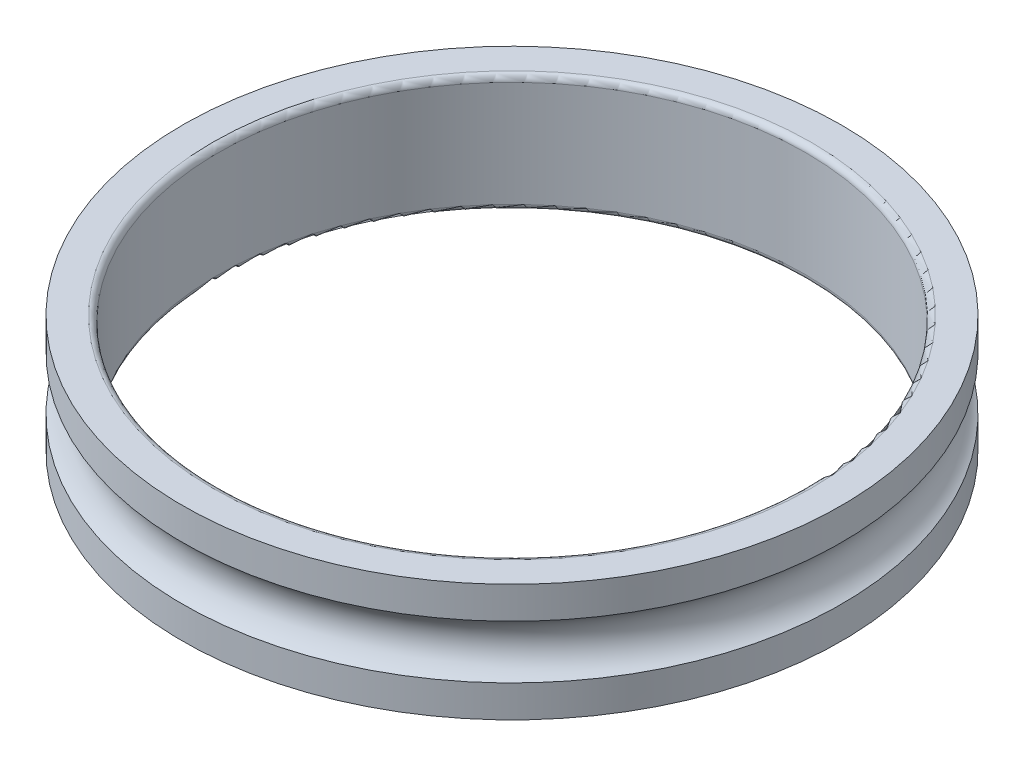
ISO-10303-21;
HEADER;
FILE_DESCRIPTION(('STEP AP214'),'2;1');
FILE_NAME('part.step','',(''),(''),'','','');
FILE_SCHEMA(('AUTOMOTIVE_DESIGN { 1 0 10303 214 1 1 1 1 }'));
ENDSEC;
DATA;
#1=APPLICATION_CONTEXT('core data for automotive mechanical design processes');
#2=APPLICATION_PROTOCOL_DEFINITION('international standard','automotive_design',2000,#1);
#3=PRODUCT_CONTEXT('',#1,'mechanical');
#4=PRODUCT('Part','Part','',(#3));
#5=PRODUCT_RELATED_PRODUCT_CATEGORY('part','',(#4));
#6=PRODUCT_DEFINITION_FORMATION('','',#4);
#7=PRODUCT_DEFINITION_CONTEXT('part definition',#1,'design');
#8=PRODUCT_DEFINITION('design','',#6,#7);
#9=PRODUCT_DEFINITION_SHAPE('','',#8);
#10=(LENGTH_UNIT() NAMED_UNIT(*) SI_UNIT(.MILLI.,.METRE.));
#11=(NAMED_UNIT(*) PLANE_ANGLE_UNIT() SI_UNIT($,.RADIAN.));
#12=(NAMED_UNIT(*) SI_UNIT($,.STERADIAN.) SOLID_ANGLE_UNIT());
#13=UNCERTAINTY_MEASURE_WITH_UNIT(LENGTH_MEASURE(1.E-05),#10,'distance_accuracy_value','');
#14=(GEOMETRIC_REPRESENTATION_CONTEXT(3) GLOBAL_UNCERTAINTY_ASSIGNED_CONTEXT((#13)) GLOBAL_UNIT_ASSIGNED_CONTEXT((#10,
#11,#12)) REPRESENTATION_CONTEXT('',''));
#15=CARTESIAN_POINT('',(0.,0.,0.));
#16=DIRECTION('',(0.,0.,1.));
#17=DIRECTION('',(1.,0.,0.));
#18=AXIS2_PLACEMENT_3D('',#15,#16,#17);
#19=CARTESIAN_POINT('',(0.,-0.54533666301317,0.));
#20=DIRECTION('',(0.,1.,0.));
#21=DIRECTION('',(0.,0.,1.));
#22=AXIS2_PLACEMENT_3D('',#19,#20,#21);
#23=CYLINDRICAL_SURFACE('',#22,11.225);
#24=CARTESIAN_POINT('',(0.,0.,0.));
#25=DIRECTION('',(0.,1.,0.));
#26=DIRECTION('',(0.,0.,1.));
#27=AXIS2_PLACEMENT_3D('',#24,#25,#26);
#28=CIRCLE('',#27,11.225);
#29=CARTESIAN_POINT('',(0.,0.,-11.225));
#30=VERTEX_POINT('',#29);
#31=EDGE_CURVE('E11',#30,#30,#28,.T.);
#32=ORIENTED_EDGE('',*,*,#31,.F.);
#33=EDGE_LOOP('',(#32));
#34=FACE_BOUND('',#33,.T.);
#35=CARTESIAN_POINT('',(0.,-1.09067332602634,0.));
#36=DIRECTION('',(0.,1.,0.));
#37=DIRECTION('',(0.,0.,1.));
#38=AXIS2_PLACEMENT_3D('',#35,#36,#37);
#39=CIRCLE('',#38,11.225);
#40=CARTESIAN_POINT('',(2.12434521794557,-1.09067332602634,11.0221496267739));
#41=VERTEX_POINT('',#40);
#42=EDGE_CURVE('E64',#41,#41,#39,.T.);
#43=ORIENTED_EDGE('',*,*,#42,.T.);
#44=EDGE_LOOP('',(#43));
#45=FACE_BOUND('',#44,.T.);
#46=ADVANCED_FACE('F17',(#34,#45),#23,.T.);
#47=CARTESIAN_POINT('',(0.,0.,10.7125));
#48=DIRECTION('',(0.,1.,0.));
#49=DIRECTION('',(1.,0.,0.));
#50=AXIS2_PLACEMENT_3D('',#47,#48,#49);
#51=PLANE('',#50);
#52=ORIENTED_EDGE('',*,*,#31,.T.);
#53=EDGE_LOOP('',(#52));
#54=FACE_BOUND('',#53,.T.);
#55=CARTESIAN_POINT('',(0.,0.,0.));
#56=DIRECTION('',(0.,1.,0.));
#57=DIRECTION('',(0.,0.,1.));
#58=AXIS2_PLACEMENT_3D('',#55,#56,#57);
#59=CIRCLE('',#58,10.2);
#60=CARTESIAN_POINT('',(0.,0.,-10.2));
#61=VERTEX_POINT('',#60);
#62=EDGE_CURVE('E71',#61,#61,#59,.T.);
#63=ORIENTED_EDGE('',*,*,#62,.F.);
#64=EDGE_LOOP('',(#63));
#65=FACE_BOUND('',#64,.T.);
#66=ADVANCED_FACE('F112',(#54,#65),#51,.T.);
#67=CARTESIAN_POINT('',(0.,-3.45466333698683,0.));
#68=DIRECTION('',(0.,1.,0.));
#69=DIRECTION('',(0.,0.,1.));
#70=AXIS2_PLACEMENT_3D('',#67,#68,#69);
#71=CYLINDRICAL_SURFACE('',#70,11.225);
#72=CARTESIAN_POINT('',(0.,-2.90932667397366,0.));
#73=DIRECTION('',(0.,1.,0.));
#74=DIRECTION('',(0.,0.,1.));
#75=AXIS2_PLACEMENT_3D('',#72,#73,#74);
#76=CIRCLE('',#75,11.225);
#77=CARTESIAN_POINT('',(2.12434521794557,-2.90932667397366,11.0221496267739));
#78=VERTEX_POINT('',#77);
#79=EDGE_CURVE('E81',#78,#78,#76,.T.);
#80=ORIENTED_EDGE('',*,*,#79,.F.);
#81=EDGE_LOOP('',(#80));
#82=FACE_BOUND('',#81,.T.);
#83=CARTESIAN_POINT('',(0.,-4.,0.));
#84=DIRECTION('',(0.,1.,0.));
#85=DIRECTION('',(0.,0.,1.));
#86=AXIS2_PLACEMENT_3D('',#83,#84,#85);
#87=CIRCLE('',#86,11.225);
#88=CARTESIAN_POINT('',(0.,-4.,-11.225));
#89=VERTEX_POINT('',#88);
#90=EDGE_CURVE('E20',#89,#89,#87,.T.);
#91=ORIENTED_EDGE('',*,*,#90,.T.);
#92=EDGE_LOOP('',(#91));
#93=FACE_BOUND('',#92,.T.);
#94=ADVANCED_FACE('F99',(#82,#93),#71,.T.);
#95=CARTESIAN_POINT('',(0.,-4.,10.7125));
#96=DIRECTION('',(0.,-1.,0.));
#97=DIRECTION('',(-1.,0.,0.));
#98=AXIS2_PLACEMENT_3D('',#95,#96,#97);
#99=PLANE('',#98);
#100=CARTESIAN_POINT('',(0.,-4.,0.));
#101=DIRECTION('',(0.,1.,0.));
#102=DIRECTION('',(0.,0.,1.));
#103=AXIS2_PLACEMENT_3D('',#100,#101,#102);
#104=CIRCLE('',#103,10.2);
#105=CARTESIAN_POINT('',(0.,-4.,-10.2));
#106=VERTEX_POINT('',#105);
#107=EDGE_CURVE('E75',#106,#106,#104,.T.);
#108=ORIENTED_EDGE('',*,*,#107,.T.);
#109=EDGE_LOOP('',(#108));
#110=FACE_BOUND('',#109,.T.);
#111=ORIENTED_EDGE('',*,*,#90,.F.);
#112=EDGE_LOOP('',(#111));
#113=FACE_BOUND('',#112,.T.);
#114=ADVANCED_FACE('F101',(#110,#113),#99,.T.);
#115=CARTESIAN_POINT('',(0.,-2.,0.));
#116=DIRECTION('',(0.,1.,0.));
#117=DIRECTION('',(0.,0.,1.));
#118=AXIS2_PLACEMENT_3D('',#115,#116,#117);
#119=TOROIDAL_SURFACE('',#118,11.75,1.05);
#120=ORIENTED_EDGE('',*,*,#79,.T.);
#121=EDGE_LOOP('',(#120));
#122=FACE_BOUND('',#121,.T.);
#123=ORIENTED_EDGE('',*,*,#42,.F.);
#124=EDGE_LOOP('',(#123));
#125=FACE_BOUND('',#124,.T.);
#126=ADVANCED_FACE('F103',(#122,#125),#119,.F.);
#127=CARTESIAN_POINT('',(0.,-0.2,0.));
#128=DIRECTION('',(0.,1.,0.));
#129=DIRECTION('',(0.,0.,1.));
#130=AXIS2_PLACEMENT_3D('',#127,#128,#129);
#131=TOROIDAL_SURFACE('',#130,10.2,0.2);
#132=CARTESIAN_POINT('',(0.,-0.2,0.));
#133=DIRECTION('',(0.,1.,0.));
#134=DIRECTION('',(0.,0.,1.));
#135=AXIS2_PLACEMENT_3D('',#132,#133,#134);
#136=CIRCLE('',#135,10.);
#137=CARTESIAN_POINT('',(0.,-0.2,-10.));
#138=VERTEX_POINT('',#137);
#139=EDGE_CURVE('E138',#138,#138,#136,.T.);
#140=ORIENTED_EDGE('',*,*,#139,.F.);
#141=EDGE_LOOP('',(#140));
#142=FACE_BOUND('',#141,.T.);
#143=ORIENTED_EDGE('',*,*,#62,.T.);
#144=EDGE_LOOP('',(#143));
#145=FACE_BOUND('',#144,.T.);
#146=ADVANCED_FACE('F72',(#142,#145),#131,.T.);
#147=CARTESIAN_POINT('',(0.,-3.8,0.));
#148=DIRECTION('',(0.,1.,0.));
#149=DIRECTION('',(0.,0.,1.));
#150=AXIS2_PLACEMENT_3D('',#147,#148,#149);
#151=TOROIDAL_SURFACE('',#150,10.2,0.2);
#152=ORIENTED_EDGE('',*,*,#107,.F.);
#153=EDGE_LOOP('',(#152));
#154=FACE_BOUND('',#153,.T.);
#155=CARTESIAN_POINT('',(0.,-3.8,0.));
#156=DIRECTION('',(0.,1.,0.));
#157=DIRECTION('',(0.,0.,1.));
#158=AXIS2_PLACEMENT_3D('',#155,#156,#157);
#159=CIRCLE('',#158,10.);
#160=CARTESIAN_POINT('',(0.,-3.8,-10.));
#161=VERTEX_POINT('',#160);
#162=EDGE_CURVE('E84',#161,#161,#159,.T.);
#163=ORIENTED_EDGE('',*,*,#162,.T.);
#164=EDGE_LOOP('',(#163));
#165=FACE_BOUND('',#164,.T.);
#166=ADVANCED_FACE('F126',(#154,#165),#151,.T.);
#167=CARTESIAN_POINT('',(0.,-2.,0.));
#168=DIRECTION('',(0.,1.,0.));
#169=DIRECTION('',(0.,0.,1.));
#170=AXIS2_PLACEMENT_3D('',#167,#168,#169);
#171=CYLINDRICAL_SURFACE('',#170,10.);
#172=ORIENTED_EDGE('',*,*,#162,.F.);
#173=EDGE_LOOP('',(#172));
#174=FACE_BOUND('',#173,.T.);
#175=ORIENTED_EDGE('',*,*,#139,.T.);
#176=EDGE_LOOP('',(#175));
#177=FACE_BOUND('',#176,.T.);
#178=ADVANCED_FACE('F128',(#174,#177),#171,.F.);
#179=CLOSED_SHELL('',(#46,#66,#94,#114,#126,#146,#166,#178));
#180=MANIFOLD_SOLID_BREP('B1',#179);
#181=ADVANCED_BREP_SHAPE_REPRESENTATION('',(#18,#180),#14);
#182=SHAPE_DEFINITION_REPRESENTATION(#9,#181);
ENDSEC;
END-ISO-10303-21;
